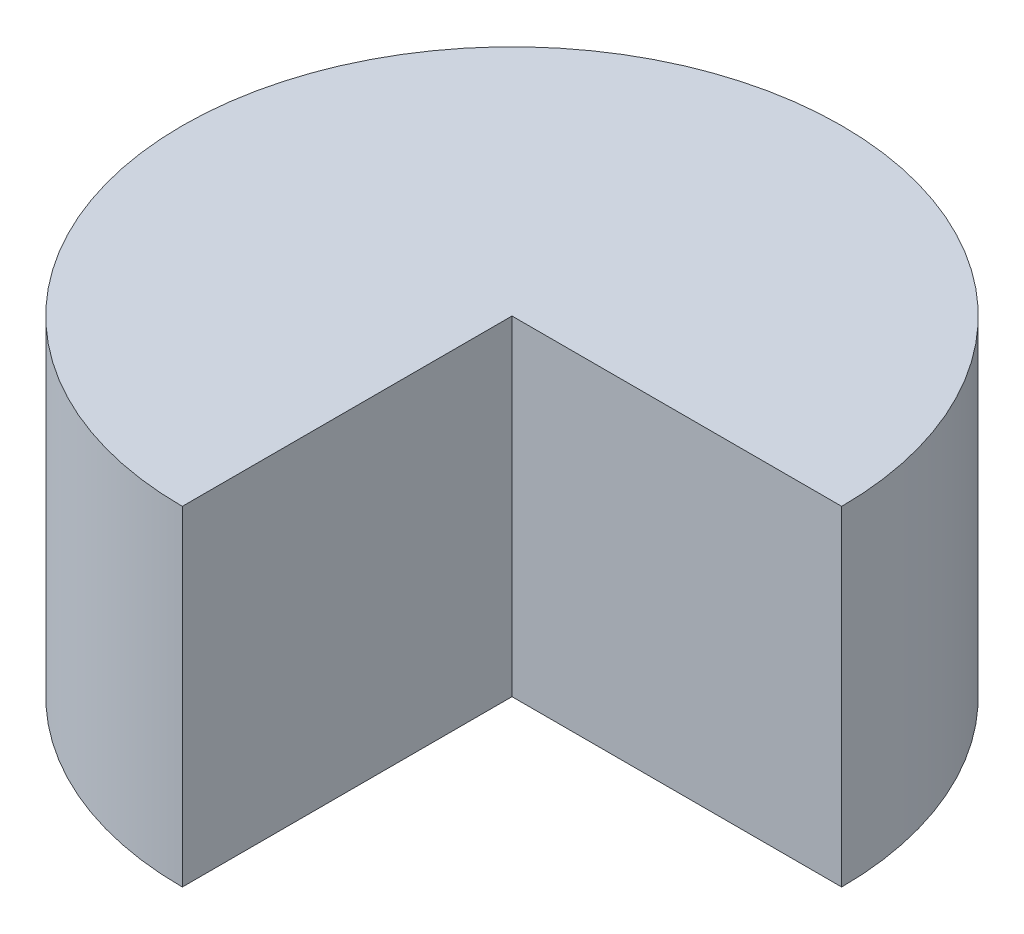
ISO-10303-21;
HEADER;
FILE_DESCRIPTION(('STEP AP214'),'2;1');
FILE_NAME('part.step','',(''),(''),'','','');
FILE_SCHEMA(('AUTOMOTIVE_DESIGN { 1 0 10303 214 1 1 1 1 }'));
ENDSEC;
DATA;
#1=APPLICATION_CONTEXT('core data for automotive mechanical design processes');
#2=APPLICATION_PROTOCOL_DEFINITION('international standard','automotive_design',2000,#1);
#3=PRODUCT_CONTEXT('',#1,'mechanical');
#4=PRODUCT('Part','Part','',(#3));
#5=PRODUCT_RELATED_PRODUCT_CATEGORY('part','',(#4));
#6=PRODUCT_DEFINITION_FORMATION('','',#4);
#7=PRODUCT_DEFINITION_CONTEXT('part definition',#1,'design');
#8=PRODUCT_DEFINITION('design','',#6,#7);
#9=PRODUCT_DEFINITION_SHAPE('','',#8);
#10=(LENGTH_UNIT() NAMED_UNIT(*) SI_UNIT(.MILLI.,.METRE.));
#11=(NAMED_UNIT(*) PLANE_ANGLE_UNIT() SI_UNIT($,.RADIAN.));
#12=(NAMED_UNIT(*) SI_UNIT($,.STERADIAN.) SOLID_ANGLE_UNIT());
#13=UNCERTAINTY_MEASURE_WITH_UNIT(LENGTH_MEASURE(1.E-05),#10,'distance_accuracy_value','');
#14=(GEOMETRIC_REPRESENTATION_CONTEXT(3) GLOBAL_UNCERTAINTY_ASSIGNED_CONTEXT((#13)) GLOBAL_UNIT_ASSIGNED_CONTEXT((#10,
#11,#12)) REPRESENTATION_CONTEXT('',''));
#15=CARTESIAN_POINT('',(0.,0.,0.));
#16=DIRECTION('',(0.,0.,1.));
#17=DIRECTION('',(1.,0.,0.));
#18=AXIS2_PLACEMENT_3D('',#15,#16,#17);
#19=CARTESIAN_POINT('',(0.,80.,0.));
#20=DIRECTION('',(1.,0.,0.));
#21=DIRECTION('',(0.,0.,-1.));
#22=AXIS2_PLACEMENT_3D('',#19,#20,#21);
#23=PLANE('',#22);
#24=DIRECTION('',(0.,0.,1.));
#25=VECTOR('',#24,1.);
#26=CARTESIAN_POINT('',(0.,0.,0.));
#27=LINE('',#26,#25);
#28=CARTESIAN_POINT('',(0.,0.,0.));
#29=VERTEX_POINT('',#28);
#30=CARTESIAN_POINT('',(0.,0.,80.));
#31=VERTEX_POINT('',#30);
#32=EDGE_CURVE('E97',#29,#31,#27,.T.);
#33=ORIENTED_EDGE('',*,*,#32,.F.);
#34=DIRECTION('',(0.,-1.,0.));
#35=VECTOR('',#34,1.);
#36=CARTESIAN_POINT('',(0.,80.,0.));
#37=LINE('',#36,#35);
#38=CARTESIAN_POINT('',(0.,80.,0.));
#39=VERTEX_POINT('',#38);
#40=EDGE_CURVE('E11',#39,#29,#37,.T.);
#41=ORIENTED_EDGE('',*,*,#40,.F.);
#42=DIRECTION('',(0.,0.,1.));
#43=VECTOR('',#42,1.);
#44=CARTESIAN_POINT('',(0.,80.,0.));
#45=LINE('',#44,#43);
#46=CARTESIAN_POINT('',(0.,80.,80.));
#47=VERTEX_POINT('',#46);
#48=EDGE_CURVE('E86',#39,#47,#45,.T.);
#49=ORIENTED_EDGE('',*,*,#48,.T.);
#50=DIRECTION('',(0.,-1.,0.));
#51=VECTOR('',#50,1.);
#52=CARTESIAN_POINT('',(0.,80.,80.));
#53=LINE('',#52,#51);
#54=EDGE_CURVE('E42',#47,#31,#53,.T.);
#55=ORIENTED_EDGE('',*,*,#54,.T.);
#56=EDGE_LOOP('',(#33,#41,#49,#55));
#57=FACE_BOUND('',#56,.T.);
#58=ADVANCED_FACE('F39',(#57),#23,.T.);
#59=CARTESIAN_POINT('',(0.,80.,0.));
#60=DIRECTION('',(0.,0.,-1.));
#61=DIRECTION('',(-1.,0.,0.));
#62=AXIS2_PLACEMENT_3D('',#59,#60,#61);
#63=PLANE('',#62);
#64=DIRECTION('',(1.,0.,0.));
#65=VECTOR('',#64,1.);
#66=CARTESIAN_POINT('',(0.,0.,0.));
#67=LINE('',#66,#65);
#68=CARTESIAN_POINT('',(80.,0.,0.));
#69=VERTEX_POINT('',#68);
#70=EDGE_CURVE('E90',#29,#69,#67,.T.);
#71=ORIENTED_EDGE('',*,*,#70,.T.);
#72=DIRECTION('',(0.,-1.,0.));
#73=VECTOR('',#72,1.);
#74=CARTESIAN_POINT('',(80.,80.,0.));
#75=LINE('',#74,#73);
#76=CARTESIAN_POINT('',(80.,80.,0.));
#77=VERTEX_POINT('',#76);
#78=EDGE_CURVE('E49',#77,#69,#75,.T.);
#79=ORIENTED_EDGE('',*,*,#78,.F.);
#80=DIRECTION('',(1.,0.,0.));
#81=VECTOR('',#80,1.);
#82=CARTESIAN_POINT('',(0.,80.,0.));
#83=LINE('',#82,#81);
#84=EDGE_CURVE('E82',#39,#77,#83,.T.);
#85=ORIENTED_EDGE('',*,*,#84,.F.);
#86=ORIENTED_EDGE('',*,*,#40,.T.);
#87=EDGE_LOOP('',(#71,#79,#85,#86));
#88=FACE_BOUND('',#87,.T.);
#89=ADVANCED_FACE('F104',(#88),#63,.F.);
#90=CARTESIAN_POINT('',(0.,80.,0.));
#91=DIRECTION('',(0.,-1.,0.));
#92=DIRECTION('',(0.,0.,-1.));
#93=AXIS2_PLACEMENT_3D('',#90,#91,#92);
#94=CYLINDRICAL_SURFACE('',#93,80.);
#95=CARTESIAN_POINT('',(0.,0.,0.));
#96=DIRECTION('',(0.,-1.,0.));
#97=DIRECTION('',(0.,0.,-1.));
#98=AXIS2_PLACEMENT_3D('',#95,#96,#97);
#99=CIRCLE('',#98,80.);
#100=EDGE_CURVE('E79',#31,#69,#99,.T.);
#101=ORIENTED_EDGE('',*,*,#100,.F.);
#102=ORIENTED_EDGE('',*,*,#54,.F.);
#103=CARTESIAN_POINT('',(0.,80.,0.));
#104=DIRECTION('',(0.,-1.,0.));
#105=DIRECTION('',(0.,0.,-1.));
#106=AXIS2_PLACEMENT_3D('',#103,#104,#105);
#107=CIRCLE('',#106,80.);
#108=EDGE_CURVE('E77',#47,#77,#107,.T.);
#109=ORIENTED_EDGE('',*,*,#108,.T.);
#110=ORIENTED_EDGE('',*,*,#78,.T.);
#111=EDGE_LOOP('',(#101,#102,#109,#110));
#112=FACE_BOUND('',#111,.T.);
#113=ADVANCED_FACE('F76',(#112),#94,.T.);
#114=CARTESIAN_POINT('',(0.,80.,0.));
#115=DIRECTION('',(0.,-1.,0.));
#116=DIRECTION('',(0.,0.,-1.));
#117=AXIS2_PLACEMENT_3D('',#114,#115,#116);
#118=PLANE('',#117);
#119=ORIENTED_EDGE('',*,*,#48,.F.);
#120=ORIENTED_EDGE('',*,*,#84,.T.);
#121=ORIENTED_EDGE('',*,*,#108,.F.);
#122=EDGE_LOOP('',(#119,#120,#121));
#123=FACE_BOUND('',#122,.T.);
#124=ADVANCED_FACE('F85',(#123),#118,.F.);
#125=CARTESIAN_POINT('',(0.,0.,0.));
#126=DIRECTION('',(0.,-1.,0.));
#127=DIRECTION('',(0.,0.,-1.));
#128=AXIS2_PLACEMENT_3D('',#125,#126,#127);
#129=PLANE('',#128);
#130=ORIENTED_EDGE('',*,*,#32,.T.);
#131=ORIENTED_EDGE('',*,*,#100,.T.);
#132=ORIENTED_EDGE('',*,*,#70,.F.);
#133=EDGE_LOOP('',(#130,#131,#132));
#134=FACE_BOUND('',#133,.T.);
#135=ADVANCED_FACE('F103',(#134),#129,.T.);
#136=CLOSED_SHELL('',(#58,#89,#113,#124,#135));
#137=MANIFOLD_SOLID_BREP('B2',#136);
#138=ADVANCED_BREP_SHAPE_REPRESENTATION('',(#18,#137),#14);
#139=SHAPE_DEFINITION_REPRESENTATION(#9,#138);
ENDSEC;
END-ISO-10303-21;
